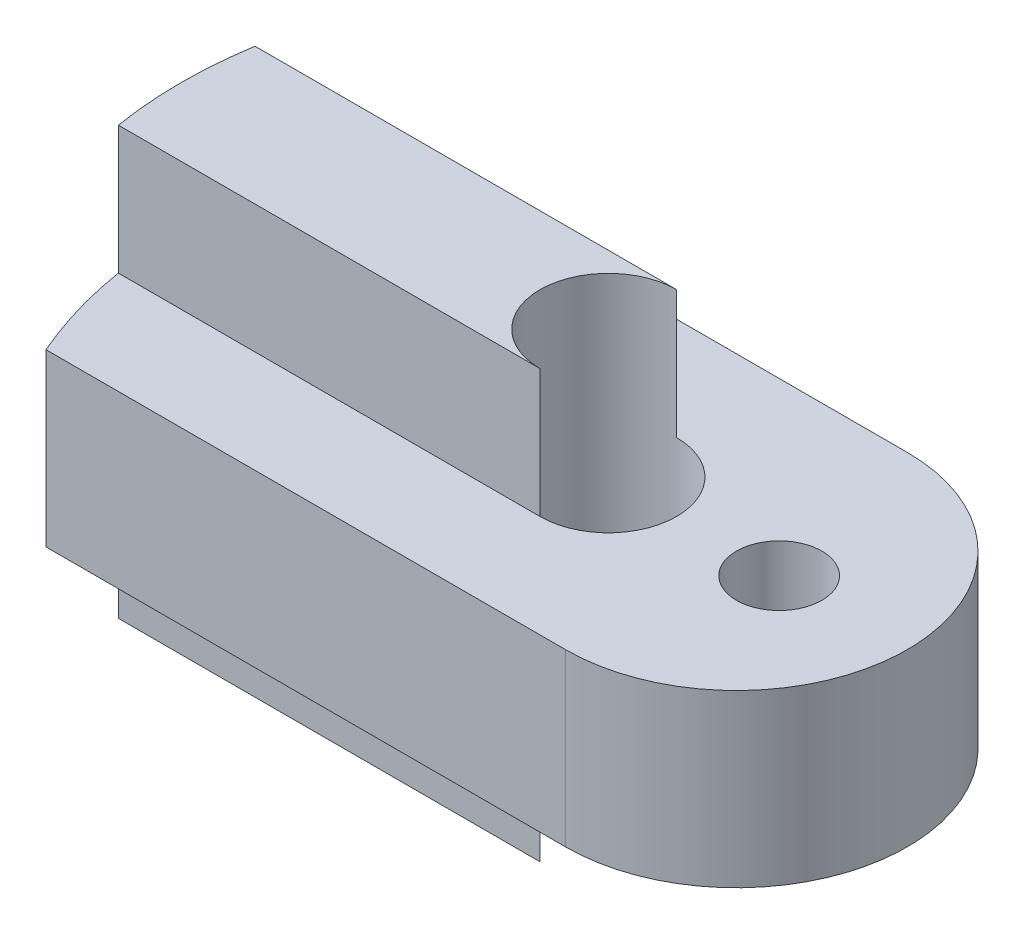
ISO-10303-21;
HEADER;
FILE_DESCRIPTION(('STEP AP214'),'2;1');
FILE_NAME('part.step','',(''),(''),'','','');
FILE_SCHEMA(('AUTOMOTIVE_DESIGN { 1 0 10303 214 1 1 1 1 }'));
ENDSEC;
DATA;
#1=APPLICATION_CONTEXT('core data for automotive mechanical design processes');
#2=APPLICATION_PROTOCOL_DEFINITION('international standard','automotive_design',2000,#1);
#3=PRODUCT_CONTEXT('',#1,'mechanical');
#4=PRODUCT('Part','Part','',(#3));
#5=PRODUCT_RELATED_PRODUCT_CATEGORY('part','',(#4));
#6=PRODUCT_DEFINITION_FORMATION('','',#4);
#7=PRODUCT_DEFINITION_CONTEXT('part definition',#1,'design');
#8=PRODUCT_DEFINITION('design','',#6,#7);
#9=PRODUCT_DEFINITION_SHAPE('','',#8);
#10=(LENGTH_UNIT() NAMED_UNIT(*) SI_UNIT(.MILLI.,.METRE.));
#11=(NAMED_UNIT(*) PLANE_ANGLE_UNIT() SI_UNIT($,.RADIAN.));
#12=(NAMED_UNIT(*) SI_UNIT($,.STERADIAN.) SOLID_ANGLE_UNIT());
#13=UNCERTAINTY_MEASURE_WITH_UNIT(LENGTH_MEASURE(1.E-05),#10,'distance_accuracy_value','');
#14=(GEOMETRIC_REPRESENTATION_CONTEXT(3) GLOBAL_UNCERTAINTY_ASSIGNED_CONTEXT((#13)) GLOBAL_UNIT_ASSIGNED_CONTEXT((#10,
#11,#12)) REPRESENTATION_CONTEXT('',''));
#15=CARTESIAN_POINT('',(0.,0.,0.));
#16=DIRECTION('',(0.,0.,1.));
#17=DIRECTION('',(1.,0.,0.));
#18=AXIS2_PLACEMENT_3D('',#15,#16,#17);
#19=CARTESIAN_POINT('',(0.,10.,-1.6));
#20=DIRECTION('',(0.,0.,1.));
#21=DIRECTION('',(1.,0.,0.));
#22=AXIS2_PLACEMENT_3D('',#19,#20,#21);
#23=PLANE('',#22);
#24=DIRECTION('',(-1.,0.,0.));
#25=VECTOR('',#24,1.);
#26=CARTESIAN_POINT('',(0.,3.,-1.6));
#27=LINE('',#26,#25);
#28=CARTESIAN_POINT('',(0.,3.,-1.6));
#29=VERTEX_POINT('',#28);
#30=CARTESIAN_POINT('',(-9.87117014340245,3.,-1.60000000000001));
#31=VERTEX_POINT('',#30);
#32=EDGE_CURVE('E177',#29,#31,#27,.T.);
#33=ORIENTED_EDGE('',*,*,#32,.F.);
#34=DIRECTION('',(0.,-1.,0.));
#35=VECTOR('',#34,1.);
#36=CARTESIAN_POINT('',(0.,10.,-1.6));
#37=LINE('',#36,#35);
#38=CARTESIAN_POINT('',(0.,0.,-1.6));
#39=VERTEX_POINT('',#38);
#40=EDGE_CURVE('E109',#29,#39,#37,.T.);
#41=ORIENTED_EDGE('',*,*,#40,.T.);
#42=DIRECTION('',(-1.,0.,0.));
#43=VECTOR('',#42,1.);
#44=CARTESIAN_POINT('',(0.,0.,-1.6));
#45=LINE('',#44,#43);
#46=CARTESIAN_POINT('',(-9.87117014340245,0.,-1.60000000000001));
#47=VERTEX_POINT('',#46);
#48=EDGE_CURVE('E93',#39,#47,#45,.T.);
#49=ORIENTED_EDGE('',*,*,#48,.T.);
#50=DIRECTION('',(0.,-1.,0.));
#51=VECTOR('',#50,1.);
#52=CARTESIAN_POINT('',(-9.87117014340245,10.,-1.60000000000001));
#53=LINE('',#52,#51);
#54=EDGE_CURVE('E89',#31,#47,#53,.T.);
#55=ORIENTED_EDGE('',*,*,#54,.F.);
#56=EDGE_LOOP('',(#33,#41,#49,#55));
#57=FACE_BOUND('',#56,.T.);
#58=ADVANCED_FACE('F33',(#57),#23,.F.);
#59=CARTESIAN_POINT('',(0.,10.,1.6));
#60=DIRECTION('',(0.,0.,-1.));
#61=DIRECTION('',(-1.,0.,0.));
#62=AXIS2_PLACEMENT_3D('',#59,#60,#61);
#63=PLANE('',#62);
#64=DIRECTION('',(1.,0.,0.));
#65=VECTOR('',#64,1.);
#66=CARTESIAN_POINT('',(0.,3.,1.6));
#67=LINE('',#66,#65);
#68=CARTESIAN_POINT('',(-9.87117014340245,3.,1.6));
#69=VERTEX_POINT('',#68);
#70=CARTESIAN_POINT('',(0.,3.,1.6));
#71=VERTEX_POINT('',#70);
#72=EDGE_CURVE('E11',#69,#71,#67,.T.);
#73=ORIENTED_EDGE('',*,*,#72,.F.);
#74=DIRECTION('',(0.,-1.,0.));
#75=VECTOR('',#74,1.);
#76=CARTESIAN_POINT('',(-9.87117014340245,10.,1.6));
#77=LINE('',#76,#75);
#78=CARTESIAN_POINT('',(-9.87117014340245,0.,1.6));
#79=VERTEX_POINT('',#78);
#80=EDGE_CURVE('E71',#69,#79,#77,.T.);
#81=ORIENTED_EDGE('',*,*,#80,.T.);
#82=DIRECTION('',(1.,0.,0.));
#83=VECTOR('',#82,1.);
#84=CARTESIAN_POINT('',(0.,0.,1.6));
#85=LINE('',#84,#83);
#86=CARTESIAN_POINT('',(0.,0.,1.6));
#87=VERTEX_POINT('',#86);
#88=EDGE_CURVE('E77',#79,#87,#85,.T.);
#89=ORIENTED_EDGE('',*,*,#88,.T.);
#90=DIRECTION('',(0.,-1.,0.));
#91=VECTOR('',#90,1.);
#92=CARTESIAN_POINT('',(0.,10.,1.6));
#93=LINE('',#92,#91);
#94=EDGE_CURVE('E104',#71,#87,#93,.T.);
#95=ORIENTED_EDGE('',*,*,#94,.F.);
#96=EDGE_LOOP('',(#73,#81,#89,#95));
#97=FACE_BOUND('',#96,.T.);
#98=ADVANCED_FACE('F73',(#97),#63,.F.);
#99=CARTESIAN_POINT('',(0.,10.,-1.6));
#100=VERTEX_POINT('',#99);
#101=CARTESIAN_POINT('',(0.,7.,-1.6));
#102=VERTEX_POINT('',#101);
#103=EDGE_CURVE('E110',#100,#102,#37,.T.);
#104=ORIENTED_EDGE('',*,*,#103,.T.);
#105=DIRECTION('',(-1.,0.,0.));
#106=VECTOR('',#105,1.);
#107=CARTESIAN_POINT('',(0.,7.,-1.6));
#108=LINE('',#107,#106);
#109=CARTESIAN_POINT('',(-9.87117014340245,7.,-1.60000000000001));
#110=VERTEX_POINT('',#109);
#111=EDGE_CURVE('E171',#102,#110,#108,.T.);
#112=ORIENTED_EDGE('',*,*,#111,.T.);
#113=CARTESIAN_POINT('',(-9.87117014340245,10.,-1.60000000000001));
#114=VERTEX_POINT('',#113);
#115=EDGE_CURVE('E107',#114,#110,#53,.T.);
#116=ORIENTED_EDGE('',*,*,#115,.F.);
#117=DIRECTION('',(-1.,0.,0.));
#118=VECTOR('',#117,1.);
#119=CARTESIAN_POINT('',(0.,10.,-1.6));
#120=LINE('',#119,#118);
#121=EDGE_CURVE('E99',#100,#114,#120,.T.);
#122=ORIENTED_EDGE('',*,*,#121,.F.);
#123=EDGE_LOOP('',(#104,#112,#116,#122));
#124=FACE_BOUND('',#123,.T.);
#125=ADVANCED_FACE('F35',(#124),#23,.F.);
#126=CARTESIAN_POINT('',(0.,10.,0.));
#127=DIRECTION('',(0.,-1.,0.));
#128=DIRECTION('',(0.,0.,-1.));
#129=AXIS2_PLACEMENT_3D('',#126,#127,#128);
#130=CYLINDRICAL_SURFACE('',#129,10.);
#131=ORIENTED_EDGE('',*,*,#115,.T.);
#132=CARTESIAN_POINT('',(0.,7.,0.));
#133=DIRECTION('',(0.,1.,0.));
#134=DIRECTION('',(0.,0.,1.));
#135=AXIS2_PLACEMENT_3D('',#132,#133,#134);
#136=CIRCLE('',#135,10.);
#137=CARTESIAN_POINT('',(-9.16515138991168,7.,-4.));
#138=VERTEX_POINT('',#137);
#139=EDGE_CURVE('E135',#138,#110,#136,.T.);
#140=ORIENTED_EDGE('',*,*,#139,.F.);
#141=DIRECTION('',(0.,1.,0.));
#142=VECTOR('',#141,1.);
#143=CARTESIAN_POINT('',(-9.16515138991168,3.,-4.));
#144=LINE('',#143,#142);
#145=CARTESIAN_POINT('',(-9.16515138991168,3.,-4.));
#146=VERTEX_POINT('',#145);
#147=EDGE_CURVE('E166',#146,#138,#144,.T.);
#148=ORIENTED_EDGE('',*,*,#147,.F.);
#149=CARTESIAN_POINT('',(0.,3.,0.));
#150=DIRECTION('',(0.,1.,0.));
#151=DIRECTION('',(0.,0.,1.));
#152=AXIS2_PLACEMENT_3D('',#149,#150,#151);
#153=CIRCLE('',#152,10.);
#154=EDGE_CURVE('E152',#146,#31,#153,.T.);
#155=ORIENTED_EDGE('',*,*,#154,.T.);
#156=ORIENTED_EDGE('',*,*,#54,.T.);
#157=CARTESIAN_POINT('',(0.,0.,0.));
#158=DIRECTION('',(0.,1.,0.));
#159=DIRECTION('',(0.,0.,1.));
#160=AXIS2_PLACEMENT_3D('',#157,#158,#159);
#161=CIRCLE('',#160,10.);
#162=EDGE_CURVE('E84',#47,#79,#161,.T.);
#163=ORIENTED_EDGE('',*,*,#162,.T.);
#164=ORIENTED_EDGE('',*,*,#80,.F.);
#165=CARTESIAN_POINT('',(-9.16515138991168,3.,4.));
#166=VERTEX_POINT('',#165);
#167=EDGE_CURVE('E151',#69,#166,#153,.T.);
#168=ORIENTED_EDGE('',*,*,#167,.T.);
#169=DIRECTION('',(0.,1.,0.));
#170=VECTOR('',#169,1.);
#171=CARTESIAN_POINT('',(-9.16515138991168,3.,4.));
#172=LINE('',#171,#170);
#173=CARTESIAN_POINT('',(-9.16515138991168,7.,4.));
#174=VERTEX_POINT('',#173);
#175=EDGE_CURVE('E133',#166,#174,#172,.T.);
#176=ORIENTED_EDGE('',*,*,#175,.T.);
#177=CARTESIAN_POINT('',(-9.87117014340245,7.,1.6));
#178=VERTEX_POINT('',#177);
#179=EDGE_CURVE('E126',#178,#174,#136,.T.);
#180=ORIENTED_EDGE('',*,*,#179,.F.);
#181=CARTESIAN_POINT('',(-9.87117014340245,10.,1.6));
#182=VERTEX_POINT('',#181);
#183=EDGE_CURVE('E81',#182,#178,#77,.T.);
#184=ORIENTED_EDGE('',*,*,#183,.F.);
#185=CARTESIAN_POINT('',(0.,10.,0.));
#186=DIRECTION('',(0.,1.,0.));
#187=DIRECTION('',(0.,0.,1.));
#188=AXIS2_PLACEMENT_3D('',#185,#186,#187);
#189=CIRCLE('',#188,10.);
#190=EDGE_CURVE('E57',#114,#182,#189,.T.);
#191=ORIENTED_EDGE('',*,*,#190,.F.);
#192=EDGE_LOOP('',(#131,#140,#148,#155,#156,#163,#164,#168,#176,#180,#184,#191));
#193=FACE_BOUND('',#192,.T.);
#194=ADVANCED_FACE('F86',(#193),#130,.T.);
#195=ORIENTED_EDGE('',*,*,#183,.T.);
#196=DIRECTION('',(1.,0.,0.));
#197=VECTOR('',#196,1.);
#198=CARTESIAN_POINT('',(0.,7.,1.6));
#199=LINE('',#198,#197);
#200=CARTESIAN_POINT('',(0.,7.,1.6));
#201=VERTEX_POINT('',#200);
#202=EDGE_CURVE('E41',#178,#201,#199,.T.);
#203=ORIENTED_EDGE('',*,*,#202,.T.);
#204=CARTESIAN_POINT('',(0.,10.,1.6));
#205=VERTEX_POINT('',#204);
#206=EDGE_CURVE('E48',#205,#201,#93,.T.);
#207=ORIENTED_EDGE('',*,*,#206,.F.);
#208=DIRECTION('',(1.,0.,0.));
#209=VECTOR('',#208,1.);
#210=CARTESIAN_POINT('',(0.,10.,1.6));
#211=LINE('',#210,#209);
#212=EDGE_CURVE('E181',#182,#205,#211,.T.);
#213=ORIENTED_EDGE('',*,*,#212,.F.);
#214=EDGE_LOOP('',(#195,#203,#207,#213));
#215=FACE_BOUND('',#214,.T.);
#216=ADVANCED_FACE('F115',(#215),#63,.F.);
#217=CARTESIAN_POINT('',(0.,10.,0.));
#218=DIRECTION('',(0.,1.,0.));
#219=DIRECTION('',(0.,0.,1.));
#220=AXIS2_PLACEMENT_3D('',#217,#218,#219);
#221=PLANE('',#220);
#222=CARTESIAN_POINT('',(0.,10.,0.));
#223=DIRECTION('',(0.,1.,0.));
#224=DIRECTION('',(0.,0.,1.));
#225=AXIS2_PLACEMENT_3D('',#222,#223,#224);
#226=CIRCLE('',#225,1.6);
#227=EDGE_CURVE('E261',#100,#205,#226,.T.);
#228=ORIENTED_EDGE('',*,*,#227,.F.);
#229=ORIENTED_EDGE('',*,*,#121,.T.);
#230=ORIENTED_EDGE('',*,*,#190,.T.);
#231=ORIENTED_EDGE('',*,*,#212,.T.);
#232=EDGE_LOOP('',(#228,#229,#230,#231));
#233=FACE_BOUND('',#232,.T.);
#234=ADVANCED_FACE('F262',(#233),#221,.T.);
#235=CARTESIAN_POINT('',(0.,0.,0.));
#236=DIRECTION('',(0.,1.,0.));
#237=DIRECTION('',(0.,0.,1.));
#238=AXIS2_PLACEMENT_3D('',#235,#236,#237);
#239=PLANE('',#238);
#240=ORIENTED_EDGE('',*,*,#48,.F.);
#241=CARTESIAN_POINT('',(0.,0.,0.));
#242=DIRECTION('',(0.,1.,0.));
#243=DIRECTION('',(0.,0.,1.));
#244=AXIS2_PLACEMENT_3D('',#241,#242,#243);
#245=CIRCLE('',#244,1.6);
#246=EDGE_CURVE('E98',#39,#87,#245,.T.);
#247=ORIENTED_EDGE('',*,*,#246,.T.);
#248=ORIENTED_EDGE('',*,*,#88,.F.);
#249=ORIENTED_EDGE('',*,*,#162,.F.);
#250=EDGE_LOOP('',(#240,#247,#248,#249));
#251=FACE_BOUND('',#250,.T.);
#252=ADVANCED_FACE('F96',(#251),#239,.F.);
#253=CARTESIAN_POINT('',(0.,3.,0.));
#254=DIRECTION('',(0.,1.,0.));
#255=DIRECTION('',(0.,0.,1.));
#256=AXIS2_PLACEMENT_3D('',#253,#254,#255);
#257=PLANE('',#256);
#258=CARTESIAN_POINT('',(4.,3.,0.));
#259=DIRECTION('',(0.,1.,0.));
#260=DIRECTION('',(0.,0.,1.));
#261=AXIS2_PLACEMENT_3D('',#258,#259,#260);
#262=CIRCLE('',#261,1.);
#263=CARTESIAN_POINT('',(4.,3.,1.));
#264=VERTEX_POINT('',#263);
#265=EDGE_CURVE('E263',#264,#264,#262,.T.);
#266=ORIENTED_EDGE('',*,*,#265,.T.);
#267=EDGE_LOOP('',(#266));
#268=FACE_BOUND('',#267,.T.);
#269=CARTESIAN_POINT('',(0.,3.,0.));
#270=DIRECTION('',(0.,1.,0.));
#271=DIRECTION('',(0.,0.,1.));
#272=AXIS2_PLACEMENT_3D('',#269,#270,#271);
#273=CIRCLE('',#272,1.6);
#274=EDGE_CURVE('E174',#71,#29,#273,.T.);
#275=ORIENTED_EDGE('',*,*,#274,.T.);
#276=ORIENTED_EDGE('',*,*,#32,.T.);
#277=ORIENTED_EDGE('',*,*,#154,.F.);
#278=DIRECTION('',(-1.,0.,0.));
#279=VECTOR('',#278,1.);
#280=CARTESIAN_POINT('',(3.,3.,-4.));
#281=LINE('',#280,#279);
#282=CARTESIAN_POINT('',(3.,3.,-4.));
#283=VERTEX_POINT('',#282);
#284=EDGE_CURVE('E154',#283,#146,#281,.T.);
#285=ORIENTED_EDGE('',*,*,#284,.F.);
#286=CARTESIAN_POINT('',(3.,3.,0.));
#287=DIRECTION('',(0.,1.,0.));
#288=DIRECTION('',(0.,0.,1.));
#289=AXIS2_PLACEMENT_3D('',#286,#287,#288);
#290=CIRCLE('',#289,4.);
#291=CARTESIAN_POINT('',(3.,3.,4.));
#292=VERTEX_POINT('',#291);
#293=EDGE_CURVE('E157',#292,#283,#290,.T.);
#294=ORIENTED_EDGE('',*,*,#293,.F.);
#295=DIRECTION('',(-1.,0.,0.));
#296=VECTOR('',#295,1.);
#297=CARTESIAN_POINT('',(3.,3.,4.));
#298=LINE('',#297,#296);
#299=EDGE_CURVE('E148',#292,#166,#298,.T.);
#300=ORIENTED_EDGE('',*,*,#299,.T.);
#301=ORIENTED_EDGE('',*,*,#167,.F.);
#302=ORIENTED_EDGE('',*,*,#72,.T.);
#303=EDGE_LOOP('',(#275,#276,#277,#285,#294,#300,#301,#302));
#304=FACE_BOUND('',#303,.T.);
#305=ADVANCED_FACE('F224',(#268,#304),#257,.F.);
#306=CARTESIAN_POINT('',(0.,7.,0.));
#307=DIRECTION('',(0.,1.,0.));
#308=DIRECTION('',(0.,0.,1.));
#309=AXIS2_PLACEMENT_3D('',#306,#307,#308);
#310=PLANE('',#309);
#311=CARTESIAN_POINT('',(4.,7.,0.));
#312=DIRECTION('',(0.,1.,0.));
#313=DIRECTION('',(0.,0.,1.));
#314=AXIS2_PLACEMENT_3D('',#311,#312,#313);
#315=CIRCLE('',#314,1.);
#316=CARTESIAN_POINT('',(4.,7.,1.));
#317=VERTEX_POINT('',#316);
#318=EDGE_CURVE('E266',#317,#317,#315,.T.);
#319=ORIENTED_EDGE('',*,*,#318,.F.);
#320=EDGE_LOOP('',(#319));
#321=FACE_BOUND('',#320,.T.);
#322=ORIENTED_EDGE('',*,*,#111,.F.);
#323=CARTESIAN_POINT('',(0.,7.,0.));
#324=DIRECTION('',(0.,1.,0.));
#325=DIRECTION('',(0.,0.,1.));
#326=AXIS2_PLACEMENT_3D('',#323,#324,#325);
#327=CIRCLE('',#326,1.6);
#328=EDGE_CURVE('E128',#201,#102,#327,.T.);
#329=ORIENTED_EDGE('',*,*,#328,.F.);
#330=ORIENTED_EDGE('',*,*,#202,.F.);
#331=ORIENTED_EDGE('',*,*,#179,.T.);
#332=DIRECTION('',(-1.,0.,0.));
#333=VECTOR('',#332,1.);
#334=CARTESIAN_POINT('',(3.,7.,4.));
#335=LINE('',#334,#333);
#336=CARTESIAN_POINT('',(3.,7.,4.));
#337=VERTEX_POINT('',#336);
#338=EDGE_CURVE('E136',#337,#174,#335,.T.);
#339=ORIENTED_EDGE('',*,*,#338,.F.);
#340=CARTESIAN_POINT('',(3.,7.,0.));
#341=DIRECTION('',(0.,1.,0.));
#342=DIRECTION('',(0.,0.,1.));
#343=AXIS2_PLACEMENT_3D('',#340,#341,#342);
#344=CIRCLE('',#343,4.);
#345=CARTESIAN_POINT('',(3.,7.,-4.));
#346=VERTEX_POINT('',#345);
#347=EDGE_CURVE('E145',#337,#346,#344,.T.);
#348=ORIENTED_EDGE('',*,*,#347,.T.);
#349=DIRECTION('',(-1.,0.,0.));
#350=VECTOR('',#349,1.);
#351=CARTESIAN_POINT('',(3.,7.,-4.));
#352=LINE('',#351,#350);
#353=EDGE_CURVE('E139',#346,#138,#352,.T.);
#354=ORIENTED_EDGE('',*,*,#353,.T.);
#355=ORIENTED_EDGE('',*,*,#139,.T.);
#356=EDGE_LOOP('',(#322,#329,#330,#331,#339,#348,#354,#355));
#357=FACE_BOUND('',#356,.T.);
#358=ADVANCED_FACE('F123',(#321,#357),#310,.T.);
#359=CARTESIAN_POINT('',(3.,3.,4.));
#360=DIRECTION('',(0.,0.,-1.));
#361=DIRECTION('',(-1.,0.,0.));
#362=AXIS2_PLACEMENT_3D('',#359,#360,#361);
#363=PLANE('',#362);
#364=DIRECTION('',(0.,1.,0.));
#365=VECTOR('',#364,1.);
#366=CARTESIAN_POINT('',(3.,3.,4.));
#367=LINE('',#366,#365);
#368=EDGE_CURVE('E160',#292,#337,#367,.T.);
#369=ORIENTED_EDGE('',*,*,#368,.T.);
#370=ORIENTED_EDGE('',*,*,#338,.T.);
#371=ORIENTED_EDGE('',*,*,#175,.F.);
#372=ORIENTED_EDGE('',*,*,#299,.F.);
#373=EDGE_LOOP('',(#369,#370,#371,#372));
#374=FACE_BOUND('',#373,.T.);
#375=ADVANCED_FACE('F230',(#374),#363,.F.);
#376=CARTESIAN_POINT('',(3.,3.,-4.));
#377=DIRECTION('',(0.,0.,-1.));
#378=DIRECTION('',(-1.,0.,0.));
#379=AXIS2_PLACEMENT_3D('',#376,#377,#378);
#380=PLANE('',#379);
#381=ORIENTED_EDGE('',*,*,#147,.T.);
#382=ORIENTED_EDGE('',*,*,#353,.F.);
#383=DIRECTION('',(0.,1.,0.));
#384=VECTOR('',#383,1.);
#385=CARTESIAN_POINT('',(3.,3.,-4.));
#386=LINE('',#385,#384);
#387=EDGE_CURVE('E163',#283,#346,#386,.T.);
#388=ORIENTED_EDGE('',*,*,#387,.F.);
#389=ORIENTED_EDGE('',*,*,#284,.T.);
#390=EDGE_LOOP('',(#381,#382,#388,#389));
#391=FACE_BOUND('',#390,.T.);
#392=ADVANCED_FACE('F236',(#391),#380,.T.);
#393=CARTESIAN_POINT('',(3.,3.,0.));
#394=DIRECTION('',(0.,1.,0.));
#395=DIRECTION('',(0.,0.,1.));
#396=AXIS2_PLACEMENT_3D('',#393,#394,#395);
#397=CYLINDRICAL_SURFACE('',#396,4.);
#398=ORIENTED_EDGE('',*,*,#387,.T.);
#399=ORIENTED_EDGE('',*,*,#347,.F.);
#400=ORIENTED_EDGE('',*,*,#368,.F.);
#401=ORIENTED_EDGE('',*,*,#293,.T.);
#402=EDGE_LOOP('',(#398,#399,#400,#401));
#403=FACE_BOUND('',#402,.T.);
#404=ADVANCED_FACE('F237',(#403),#397,.T.);
#405=CARTESIAN_POINT('',(0.,0.,0.));
#406=DIRECTION('',(0.,1.,0.));
#407=DIRECTION('',(0.,0.,1.));
#408=AXIS2_PLACEMENT_3D('',#405,#406,#407);
#409=CYLINDRICAL_SURFACE('',#408,1.6);
#410=ORIENTED_EDGE('',*,*,#40,.F.);
#411=ORIENTED_EDGE('',*,*,#274,.F.);
#412=ORIENTED_EDGE('',*,*,#94,.T.);
#413=ORIENTED_EDGE('',*,*,#246,.F.);
#414=EDGE_LOOP('',(#410,#411,#412,#413));
#415=FACE_BOUND('',#414,.T.);
#416=ORIENTED_EDGE('',*,*,#103,.F.);
#417=ORIENTED_EDGE('',*,*,#227,.T.);
#418=ORIENTED_EDGE('',*,*,#206,.T.);
#419=ORIENTED_EDGE('',*,*,#328,.T.);
#420=EDGE_LOOP('',(#416,#417,#418,#419));
#421=FACE_BOUND('',#420,.T.);
#422=ADVANCED_FACE('F222',(#415,#421),#409,.F.);
#423=CARTESIAN_POINT('',(4.,0.,0.));
#424=DIRECTION('',(0.,1.,0.));
#425=DIRECTION('',(0.,0.,1.));
#426=AXIS2_PLACEMENT_3D('',#423,#424,#425);
#427=CYLINDRICAL_SURFACE('',#426,1.);
#428=ORIENTED_EDGE('',*,*,#318,.T.);
#429=EDGE_LOOP('',(#428));
#430=FACE_BOUND('',#429,.T.);
#431=ORIENTED_EDGE('',*,*,#265,.F.);
#432=EDGE_LOOP('',(#431));
#433=FACE_BOUND('',#432,.T.);
#434=ADVANCED_FACE('F244',(#430,#433),#427,.F.);
#435=CLOSED_SHELL('',(#58,#98,#125,#194,#216,#234,#252,#305,#358,#375,#392,#404,#422,#434));
#436=MANIFOLD_SOLID_BREP('B2',#435);
#437=ADVANCED_BREP_SHAPE_REPRESENTATION('',(#18,#436),#14);
#438=SHAPE_DEFINITION_REPRESENTATION(#9,#437);
ENDSEC;
END-ISO-10303-21;
